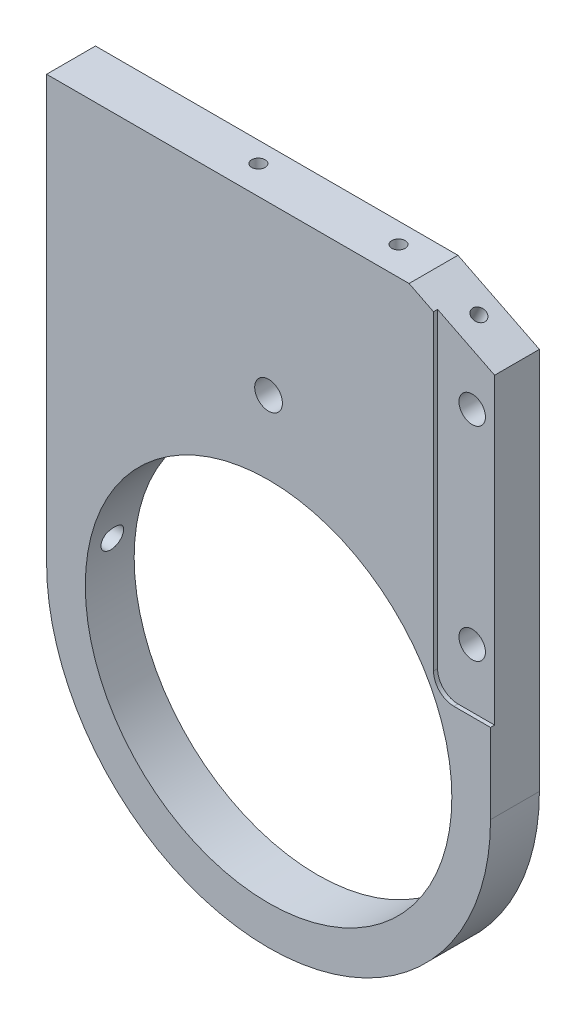
ISO-10303-21;
HEADER;
FILE_DESCRIPTION(('STEP AP214'),'2;1');
FILE_NAME('part.step','',(''),(''),'','','');
FILE_SCHEMA(('AUTOMOTIVE_DESIGN { 1 0 10303 214 1 1 1 1 }'));
ENDSEC;
DATA;
#1=APPLICATION_CONTEXT('core data for automotive mechanical design processes');
#2=APPLICATION_PROTOCOL_DEFINITION('international standard','automotive_design',2000,#1);
#3=PRODUCT_CONTEXT('',#1,'mechanical');
#4=PRODUCT('Part','Part','',(#3));
#5=PRODUCT_RELATED_PRODUCT_CATEGORY('part','',(#4));
#6=PRODUCT_DEFINITION_FORMATION('','',#4);
#7=PRODUCT_DEFINITION_CONTEXT('part definition',#1,'design');
#8=PRODUCT_DEFINITION('design','',#6,#7);
#9=PRODUCT_DEFINITION_SHAPE('','',#8);
#10=(LENGTH_UNIT() NAMED_UNIT(*) SI_UNIT(.MILLI.,.METRE.));
#11=(NAMED_UNIT(*) PLANE_ANGLE_UNIT() SI_UNIT($,.RADIAN.));
#12=(NAMED_UNIT(*) SI_UNIT($,.STERADIAN.) SOLID_ANGLE_UNIT());
#13=UNCERTAINTY_MEASURE_WITH_UNIT(LENGTH_MEASURE(1.E-05),#10,'distance_accuracy_value','');
#14=(GEOMETRIC_REPRESENTATION_CONTEXT(3) GLOBAL_UNCERTAINTY_ASSIGNED_CONTEXT((#13)) GLOBAL_UNIT_ASSIGNED_CONTEXT((#10,
#11,#12)) REPRESENTATION_CONTEXT('',''));
#15=CARTESIAN_POINT('',(0.,0.,0.));
#16=DIRECTION('',(0.,0.,1.));
#17=DIRECTION('',(1.,0.,0.));
#18=AXIS2_PLACEMENT_3D('',#15,#16,#17);
#19=CARTESIAN_POINT('',(49.,34.,-32.7));
#20=DIRECTION('',(0.,0.,1.));
#21=DIRECTION('',(1.,0.,0.));
#22=AXIS2_PLACEMENT_3D('',#19,#20,#21);
#23=CYLINDRICAL_SURFACE('',#22,3.25);
#24=CARTESIAN_POINT('',(49.,34.,5.));
#25=DIRECTION('',(0.,0.,1.));
#26=DIRECTION('',(1.,0.,0.));
#27=AXIS2_PLACEMENT_3D('',#24,#25,#26);
#28=CIRCLE('',#27,3.25);
#29=CARTESIAN_POINT('',(52.25,34.,5.));
#30=VERTEX_POINT('',#29);
#31=EDGE_CURVE('E210',#30,#30,#28,.T.);
#32=ORIENTED_EDGE('',*,*,#31,.T.);
#33=EDGE_LOOP('',(#32));
#34=FACE_BOUND('',#33,.T.);
#35=CARTESIAN_POINT('',(49.,34.,0.));
#36=DIRECTION('',(0.,0.,-1.));
#37=DIRECTION('',(-1.,0.,0.));
#38=AXIS2_PLACEMENT_3D('',#35,#36,#37);
#39=CIRCLE('',#38,3.25);
#40=CARTESIAN_POINT('',(45.75,34.,0.));
#41=VERTEX_POINT('',#40);
#42=EDGE_CURVE('E212',#41,#41,#39,.F.);
#43=ORIENTED_EDGE('',*,*,#42,.F.);
#44=EDGE_LOOP('',(#43));
#45=FACE_BOUND('',#44,.T.);
#46=ADVANCED_FACE('F36',(#34,#45),#23,.F.);
#47=CARTESIAN_POINT('',(49.,84.,-32.7));
#48=DIRECTION('',(0.,0.,1.));
#49=DIRECTION('',(1.,0.,0.));
#50=AXIS2_PLACEMENT_3D('',#47,#48,#49);
#51=CYLINDRICAL_SURFACE('',#50,3.25);
#52=CARTESIAN_POINT('',(49.,84.,5.));
#53=DIRECTION('',(0.,0.,1.));
#54=DIRECTION('',(1.,0.,0.));
#55=AXIS2_PLACEMENT_3D('',#52,#53,#54);
#56=CIRCLE('',#55,3.25);
#57=CARTESIAN_POINT('',(52.25,84.,5.));
#58=VERTEX_POINT('',#57);
#59=EDGE_CURVE('E343',#58,#58,#56,.T.);
#60=ORIENTED_EDGE('',*,*,#59,.T.);
#61=EDGE_LOOP('',(#60));
#62=FACE_BOUND('',#61,.T.);
#63=CARTESIAN_POINT('',(49.,84.,0.));
#64=DIRECTION('',(0.,0.,-1.));
#65=DIRECTION('',(-1.,0.,0.));
#66=AXIS2_PLACEMENT_3D('',#63,#64,#65);
#67=CIRCLE('',#66,3.25);
#68=CARTESIAN_POINT('',(45.75,84.,0.));
#69=VERTEX_POINT('',#68);
#70=EDGE_CURVE('E207',#69,#69,#67,.F.);
#71=ORIENTED_EDGE('',*,*,#70,.F.);
#72=EDGE_LOOP('',(#71));
#73=FACE_BOUND('',#72,.T.);
#74=ADVANCED_FACE('F264',(#62,#73),#51,.F.);
#75=CARTESIAN_POINT('',(0.,0.,6.));
#76=DIRECTION('',(0.,0.,1.));
#77=DIRECTION('',(1.,0.,0.));
#78=AXIS2_PLACEMENT_3D('',#75,#76,#77);
#79=PLANE('',#78);
#80=CARTESIAN_POINT('',(0.,63.,6.));
#81=DIRECTION('',(0.,0.,1.));
#82=DIRECTION('',(1.,0.,0.));
#83=AXIS2_PLACEMENT_3D('',#80,#81,#82);
#84=CIRCLE('',#83,3.39999999999999);
#85=CARTESIAN_POINT('',(3.39999999999999,63.,6.));
#86=VERTEX_POINT('',#85);
#87=EDGE_CURVE('E378',#86,#86,#84,.T.);
#88=ORIENTED_EDGE('',*,*,#87,.F.);
#89=EDGE_LOOP('',(#88));
#90=FACE_BOUND('',#89,.T.);
#91=DIRECTION('',(0.,-1.,0.));
#92=VECTOR('',#91,1.);
#93=CARTESIAN_POINT('',(40.5,104.,6.));
#94=LINE('',#93,#92);
#95=CARTESIAN_POINT('',(40.5,101.,6.));
#96=VERTEX_POINT('',#95);
#97=CARTESIAN_POINT('',(40.5,24.6,6.));
#98=VERTEX_POINT('',#97);
#99=EDGE_CURVE('E341',#96,#98,#94,.T.);
#100=ORIENTED_EDGE('',*,*,#99,.F.);
#101=DIRECTION('',(-0.894427190999916,0.447213595499958,0.));
#102=VECTOR('',#101,1.);
#103=CARTESIAN_POINT('',(34.5,104.,6.));
#104=LINE('',#103,#102);
#105=CARTESIAN_POINT('',(34.5,104.,6.));
#106=VERTEX_POINT('',#105);
#107=EDGE_CURVE('E170',#96,#106,#104,.T.);
#108=ORIENTED_EDGE('',*,*,#107,.T.);
#109=DIRECTION('',(-1.,0.,0.));
#110=VECTOR('',#109,1.);
#111=CARTESIAN_POINT('',(-54.5,104.,6.));
#112=LINE('',#111,#110);
#113=CARTESIAN_POINT('',(-54.5,104.,6.));
#114=VERTEX_POINT('',#113);
#115=EDGE_CURVE('E172',#106,#114,#112,.T.);
#116=ORIENTED_EDGE('',*,*,#115,.T.);
#117=DIRECTION('',(0.,-1.,0.));
#118=VECTOR('',#117,1.);
#119=CARTESIAN_POINT('',(-54.5,0.,6.));
#120=LINE('',#119,#118);
#121=CARTESIAN_POINT('',(-54.5,0.,6.));
#122=VERTEX_POINT('',#121);
#123=EDGE_CURVE('E174',#114,#122,#120,.T.);
#124=ORIENTED_EDGE('',*,*,#123,.T.);
#125=CARTESIAN_POINT('',(0.,0.,6.));
#126=DIRECTION('',(0.,0.,1.));
#127=DIRECTION('',(1.,0.,0.));
#128=AXIS2_PLACEMENT_3D('',#125,#126,#127);
#129=CIRCLE('',#128,54.5);
#130=CARTESIAN_POINT('',(54.5,0.,6.));
#131=VERTEX_POINT('',#130);
#132=EDGE_CURVE('E163',#122,#131,#129,.T.);
#133=ORIENTED_EDGE('',*,*,#132,.T.);
#134=DIRECTION('',(0.,1.,0.));
#135=VECTOR('',#134,1.);
#136=CARTESIAN_POINT('',(54.5,94.,6.));
#137=LINE('',#136,#135);
#138=CARTESIAN_POINT('',(54.5,19.6,6.));
#139=VERTEX_POINT('',#138);
#140=EDGE_CURVE('E166',#131,#139,#137,.T.);
#141=ORIENTED_EDGE('',*,*,#140,.T.);
#142=DIRECTION('',(1.,0.,0.));
#143=VECTOR('',#142,1.);
#144=CARTESIAN_POINT('',(45.5,19.6,6.));
#145=LINE('',#144,#143);
#146=CARTESIAN_POINT('',(45.5,19.6,6.));
#147=VERTEX_POINT('',#146);
#148=EDGE_CURVE('E335',#147,#139,#145,.T.);
#149=ORIENTED_EDGE('',*,*,#148,.F.);
#150=CARTESIAN_POINT('',(45.5,24.6,6.));
#151=DIRECTION('',(0.,0.,1.));
#152=DIRECTION('',(1.,0.,0.));
#153=AXIS2_PLACEMENT_3D('',#150,#151,#152);
#154=CIRCLE('',#153,5.);
#155=EDGE_CURVE('E338',#98,#147,#154,.T.);
#156=ORIENTED_EDGE('',*,*,#155,.F.);
#157=EDGE_LOOP('',(#100,#108,#116,#124,#133,#141,#149,#156));
#158=FACE_BOUND('',#157,.T.);
#159=CARTESIAN_POINT('',(0.,0.,6.));
#160=DIRECTION('',(0.,0.,1.));
#161=DIRECTION('',(1.,0.,0.));
#162=AXIS2_PLACEMENT_3D('',#159,#160,#161);
#163=CIRCLE('',#162,45.);
#164=CARTESIAN_POINT('',(45.,0.,6.));
#165=VERTEX_POINT('',#164);
#166=EDGE_CURVE('E150',#165,#165,#163,.T.);
#167=ORIENTED_EDGE('',*,*,#166,.F.);
#168=EDGE_LOOP('',(#167));
#169=FACE_BOUND('',#168,.T.);
#170=ADVANCED_FACE('F268',(#90,#158,#169),#79,.T.);
#171=CARTESIAN_POINT('',(0.,0.,-6.));
#172=DIRECTION('',(0.,0.,1.));
#173=DIRECTION('',(1.,0.,0.));
#174=AXIS2_PLACEMENT_3D('',#171,#172,#173);
#175=PLANE('',#174);
#176=CARTESIAN_POINT('',(0.,63.,-6.));
#177=DIRECTION('',(0.,0.,1.));
#178=DIRECTION('',(1.,0.,0.));
#179=AXIS2_PLACEMENT_3D('',#176,#177,#178);
#180=CIRCLE('',#179,3.4);
#181=CARTESIAN_POINT('',(3.4,63.,-6.));
#182=VERTEX_POINT('',#181);
#183=EDGE_CURVE('E375',#182,#182,#180,.T.);
#184=ORIENTED_EDGE('',*,*,#183,.T.);
#185=EDGE_LOOP('',(#184));
#186=FACE_BOUND('',#185,.T.);
#187=CARTESIAN_POINT('',(49.,34.,-6.));
#188=DIRECTION('',(0.,0.,-1.));
#189=DIRECTION('',(-1.,0.,0.));
#190=AXIS2_PLACEMENT_3D('',#187,#188,#189);
#191=CIRCLE('',#190,5.);
#192=CARTESIAN_POINT('',(44.,34.,-6.));
#193=VERTEX_POINT('',#192);
#194=EDGE_CURVE('E357',#193,#193,#191,.T.);
#195=ORIENTED_EDGE('',*,*,#194,.F.);
#196=EDGE_LOOP('',(#195));
#197=FACE_BOUND('',#196,.T.);
#198=CARTESIAN_POINT('',(49.,84.,-6.));
#199=DIRECTION('',(0.,0.,-1.));
#200=DIRECTION('',(-1.,0.,0.));
#201=AXIS2_PLACEMENT_3D('',#198,#199,#200);
#202=CIRCLE('',#201,5.);
#203=CARTESIAN_POINT('',(44.,84.,-6.));
#204=VERTEX_POINT('',#203);
#205=EDGE_CURVE('E214',#204,#204,#202,.T.);
#206=ORIENTED_EDGE('',*,*,#205,.F.);
#207=EDGE_LOOP('',(#206));
#208=FACE_BOUND('',#207,.T.);
#209=CARTESIAN_POINT('',(0.,0.,-6.));
#210=DIRECTION('',(0.,0.,1.));
#211=DIRECTION('',(1.,0.,0.));
#212=AXIS2_PLACEMENT_3D('',#209,#210,#211);
#213=CIRCLE('',#212,54.5);
#214=CARTESIAN_POINT('',(-54.5,0.,-6.));
#215=VERTEX_POINT('',#214);
#216=CARTESIAN_POINT('',(54.5,0.,-6.));
#217=VERTEX_POINT('',#216);
#218=EDGE_CURVE('E157',#215,#217,#213,.T.);
#219=ORIENTED_EDGE('',*,*,#218,.F.);
#220=DIRECTION('',(0.,-1.,0.));
#221=VECTOR('',#220,1.);
#222=CARTESIAN_POINT('',(-54.5,0.,-6.));
#223=LINE('',#222,#221);
#224=CARTESIAN_POINT('',(-54.5,104.,-6.));
#225=VERTEX_POINT('',#224);
#226=EDGE_CURVE('E167',#225,#215,#223,.T.);
#227=ORIENTED_EDGE('',*,*,#226,.F.);
#228=DIRECTION('',(-1.,0.,0.));
#229=VECTOR('',#228,1.);
#230=CARTESIAN_POINT('',(-54.5,104.,-6.));
#231=LINE('',#230,#229);
#232=CARTESIAN_POINT('',(34.5,104.,-6.));
#233=VERTEX_POINT('',#232);
#234=EDGE_CURVE('E184',#233,#225,#231,.T.);
#235=ORIENTED_EDGE('',*,*,#234,.F.);
#236=DIRECTION('',(-0.894427190999916,0.447213595499958,0.));
#237=VECTOR('',#236,1.);
#238=CARTESIAN_POINT('',(34.5,104.,-6.));
#239=LINE('',#238,#237);
#240=CARTESIAN_POINT('',(54.5,94.,-6.));
#241=VERTEX_POINT('',#240);
#242=EDGE_CURVE('E182',#241,#233,#239,.T.);
#243=ORIENTED_EDGE('',*,*,#242,.F.);
#244=DIRECTION('',(0.,1.,0.));
#245=VECTOR('',#244,1.);
#246=CARTESIAN_POINT('',(54.5,94.,-6.));
#247=LINE('',#246,#245);
#248=EDGE_CURVE('E179',#217,#241,#247,.T.);
#249=ORIENTED_EDGE('',*,*,#248,.F.);
#250=EDGE_LOOP('',(#219,#227,#235,#243,#249));
#251=FACE_BOUND('',#250,.T.);
#252=CARTESIAN_POINT('',(0.,0.,-6.));
#253=DIRECTION('',(0.,0.,1.));
#254=DIRECTION('',(1.,0.,0.));
#255=AXIS2_PLACEMENT_3D('',#252,#253,#254);
#256=CIRCLE('',#255,45.);
#257=CARTESIAN_POINT('',(45.,0.,-6.));
#258=VERTEX_POINT('',#257);
#259=EDGE_CURVE('E153',#258,#258,#256,.T.);
#260=ORIENTED_EDGE('',*,*,#259,.T.);
#261=EDGE_LOOP('',(#260));
#262=FACE_BOUND('',#261,.T.);
#263=ADVANCED_FACE('F386',(#186,#197,#208,#251,#262),#175,.F.);
#264=CARTESIAN_POINT('',(0.,0.,6.));
#265=DIRECTION('',(0.,0.,-1.));
#266=DIRECTION('',(-1.,0.,0.));
#267=AXIS2_PLACEMENT_3D('',#264,#265,#266);
#268=CYLINDRICAL_SURFACE('',#267,54.5);
#269=ORIENTED_EDGE('',*,*,#218,.T.);
#270=DIRECTION('',(0.,0.,-1.));
#271=VECTOR('',#270,1.);
#272=CARTESIAN_POINT('',(54.5,0.,6.));
#273=LINE('',#272,#271);
#274=EDGE_CURVE('E197',#131,#217,#273,.T.);
#275=ORIENTED_EDGE('',*,*,#274,.F.);
#276=ORIENTED_EDGE('',*,*,#132,.F.);
#277=DIRECTION('',(0.,0.,-1.));
#278=VECTOR('',#277,1.);
#279=CARTESIAN_POINT('',(-54.5,0.,6.));
#280=LINE('',#279,#278);
#281=EDGE_CURVE('E176',#122,#215,#280,.T.);
#282=ORIENTED_EDGE('',*,*,#281,.T.);
#283=EDGE_LOOP('',(#269,#275,#276,#282));
#284=FACE_BOUND('',#283,.T.);
#285=ADVANCED_FACE('F38',(#284),#268,.T.);
#286=CARTESIAN_POINT('',(54.5,94.,6.));
#287=DIRECTION('',(-1.,0.,0.));
#288=DIRECTION('',(0.,-1.,0.));
#289=AXIS2_PLACEMENT_3D('',#286,#287,#288);
#290=PLANE('',#289);
#291=DIRECTION('',(0.,1.,0.));
#292=VECTOR('',#291,1.);
#293=CARTESIAN_POINT('',(54.5,94.,5.));
#294=LINE('',#293,#292);
#295=CARTESIAN_POINT('',(54.5,19.6,5.));
#296=VERTEX_POINT('',#295);
#297=CARTESIAN_POINT('',(54.5,94.,5.));
#298=VERTEX_POINT('',#297);
#299=EDGE_CURVE('E63',#296,#298,#294,.T.);
#300=ORIENTED_EDGE('',*,*,#299,.F.);
#301=DIRECTION('',(0.,0.,1.));
#302=VECTOR('',#301,1.);
#303=CARTESIAN_POINT('',(54.5,19.6,6.));
#304=LINE('',#303,#302);
#305=EDGE_CURVE('E135',#296,#139,#304,.T.);
#306=ORIENTED_EDGE('',*,*,#305,.T.);
#307=ORIENTED_EDGE('',*,*,#140,.F.);
#308=ORIENTED_EDGE('',*,*,#274,.T.);
#309=ORIENTED_EDGE('',*,*,#248,.T.);
#310=DIRECTION('',(0.,0.,-1.));
#311=VECTOR('',#310,1.);
#312=CARTESIAN_POINT('',(54.5,94.,6.));
#313=LINE('',#312,#311);
#314=EDGE_CURVE('E195',#298,#241,#313,.T.);
#315=ORIENTED_EDGE('',*,*,#314,.F.);
#316=EDGE_LOOP('',(#300,#306,#307,#308,#309,#315));
#317=FACE_BOUND('',#316,.T.);
#318=ADVANCED_FACE('F411',(#317),#290,.F.);
#319=CARTESIAN_POINT('',(34.5,104.,6.));
#320=DIRECTION('',(-0.447213595499958,-0.894427190999916,0.));
#321=DIRECTION('',(0.894427190999916,-0.447213595499958,0.));
#322=AXIS2_PLACEMENT_3D('',#319,#320,#321);
#323=PLANE('',#322);
#324=CARTESIAN_POINT('',(44.6613008990009,98.9193495504995,-1.));
#325=DIRECTION('',(0.447213595499958,0.894427190999916,0.));
#326=DIRECTION('',(-0.894427190999916,0.447213595499958,0.));
#327=AXIS2_PLACEMENT_3D('',#324,#325,#326);
#328=CIRCLE('',#327,1.64999999999999);
#329=CARTESIAN_POINT('',(43.1854960338511,99.6572519830745,-1.));
#330=VERTEX_POINT('',#329);
#331=EDGE_CURVE('E160',#330,#330,#328,.T.);
#332=ORIENTED_EDGE('',*,*,#331,.F.);
#333=EDGE_LOOP('',(#332));
#334=FACE_BOUND('',#333,.T.);
#335=ORIENTED_EDGE('',*,*,#107,.F.);
#336=DIRECTION('',(0.,0.,-1.));
#337=VECTOR('',#336,1.);
#338=CARTESIAN_POINT('',(40.5,101.,6.));
#339=LINE('',#338,#337);
#340=CARTESIAN_POINT('',(40.5,101.,5.));
#341=VERTEX_POINT('',#340);
#342=EDGE_CURVE('E202',#96,#341,#339,.T.);
#343=ORIENTED_EDGE('',*,*,#342,.T.);
#344=DIRECTION('',(-0.894427190999916,0.447213595499958,0.));
#345=VECTOR('',#344,1.);
#346=CARTESIAN_POINT('',(34.5,104.,5.));
#347=LINE('',#346,#345);
#348=EDGE_CURVE('E200',#298,#341,#347,.T.);
#349=ORIENTED_EDGE('',*,*,#348,.F.);
#350=ORIENTED_EDGE('',*,*,#314,.T.);
#351=ORIENTED_EDGE('',*,*,#242,.T.);
#352=DIRECTION('',(0.,0.,-1.));
#353=VECTOR('',#352,1.);
#354=CARTESIAN_POINT('',(34.5,104.,6.));
#355=LINE('',#354,#353);
#356=EDGE_CURVE('E192',#106,#233,#355,.T.);
#357=ORIENTED_EDGE('',*,*,#356,.F.);
#358=EDGE_LOOP('',(#335,#343,#349,#350,#351,#357));
#359=FACE_BOUND('',#358,.T.);
#360=ADVANCED_FACE('F395',(#334,#359),#323,.F.);
#361=CARTESIAN_POINT('',(-54.5,104.,6.));
#362=DIRECTION('',(0.,-1.,0.));
#363=DIRECTION('',(0.,0.,-1.));
#364=AXIS2_PLACEMENT_3D('',#361,#362,#363);
#365=PLANE('',#364);
#366=CARTESIAN_POINT('',(-9.5,104.,-1.));
#367=DIRECTION('',(0.,1.,0.));
#368=DIRECTION('',(0.,0.,1.));
#369=AXIS2_PLACEMENT_3D('',#366,#367,#368);
#370=CIRCLE('',#369,1.64999999999999);
#371=CARTESIAN_POINT('',(-9.5,104.,0.64999999999999));
#372=VERTEX_POINT('',#371);
#373=EDGE_CURVE('E325',#372,#372,#370,.T.);
#374=ORIENTED_EDGE('',*,*,#373,.F.);
#375=EDGE_LOOP('',(#374));
#376=FACE_BOUND('',#375,.T.);
#377=CARTESIAN_POINT('',(24.9,104.,-1.));
#378=DIRECTION('',(0.,1.,0.));
#379=DIRECTION('',(0.,0.,1.));
#380=AXIS2_PLACEMENT_3D('',#377,#378,#379);
#381=CIRCLE('',#380,1.64999999999999);
#382=CARTESIAN_POINT('',(24.9,104.,0.649999999999992));
#383=VERTEX_POINT('',#382);
#384=EDGE_CURVE('E317',#383,#383,#381,.T.);
#385=ORIENTED_EDGE('',*,*,#384,.F.);
#386=EDGE_LOOP('',(#385));
#387=FACE_BOUND('',#386,.T.);
#388=ORIENTED_EDGE('',*,*,#234,.T.);
#389=DIRECTION('',(0.,0.,-1.));
#390=VECTOR('',#389,1.);
#391=CARTESIAN_POINT('',(-54.5,104.,6.));
#392=LINE('',#391,#390);
#393=EDGE_CURVE('E189',#114,#225,#392,.T.);
#394=ORIENTED_EDGE('',*,*,#393,.F.);
#395=ORIENTED_EDGE('',*,*,#115,.F.);
#396=ORIENTED_EDGE('',*,*,#356,.T.);
#397=EDGE_LOOP('',(#388,#394,#395,#396));
#398=FACE_BOUND('',#397,.T.);
#399=ADVANCED_FACE('F401',(#376,#387,#398),#365,.F.);
#400=CARTESIAN_POINT('',(-54.5,0.,6.));
#401=DIRECTION('',(1.,0.,0.));
#402=DIRECTION('',(0.,0.,-1.));
#403=AXIS2_PLACEMENT_3D('',#400,#401,#402);
#404=PLANE('',#403);
#405=CARTESIAN_POINT('',(-54.5,7.49999999999999,0.));
#406=DIRECTION('',(-1.,0.,0.));
#407=DIRECTION('',(0.,0.,1.));
#408=AXIS2_PLACEMENT_3D('',#405,#406,#407);
#409=CIRCLE('',#408,2.74999999999999);
#410=CARTESIAN_POINT('',(-54.5,7.49999999999999,2.74999999999999));
#411=VERTEX_POINT('',#410);
#412=EDGE_CURVE('E140',#411,#411,#409,.T.);
#413=ORIENTED_EDGE('',*,*,#412,.F.);
#414=EDGE_LOOP('',(#413));
#415=FACE_BOUND('',#414,.T.);
#416=CARTESIAN_POINT('',(-54.5,96.5,0.));
#417=DIRECTION('',(-1.,0.,0.));
#418=DIRECTION('',(0.,0.,1.));
#419=AXIS2_PLACEMENT_3D('',#416,#417,#418);
#420=CIRCLE('',#419,2.75);
#421=CARTESIAN_POINT('',(-54.5,96.5,2.75));
#422=VERTEX_POINT('',#421);
#423=EDGE_CURVE('E139',#422,#422,#420,.T.);
#424=ORIENTED_EDGE('',*,*,#423,.F.);
#425=EDGE_LOOP('',(#424));
#426=FACE_BOUND('',#425,.T.);
#427=CARTESIAN_POINT('',(-54.5,51.7,0.));
#428=DIRECTION('',(-1.,0.,0.));
#429=DIRECTION('',(0.,0.,1.));
#430=AXIS2_PLACEMENT_3D('',#427,#428,#429);
#431=CIRCLE('',#430,2.75);
#432=CARTESIAN_POINT('',(-54.5,51.7,2.75));
#433=VERTEX_POINT('',#432);
#434=EDGE_CURVE('E365',#433,#433,#431,.T.);
#435=ORIENTED_EDGE('',*,*,#434,.F.);
#436=EDGE_LOOP('',(#435));
#437=FACE_BOUND('',#436,.T.);
#438=ORIENTED_EDGE('',*,*,#226,.T.);
#439=ORIENTED_EDGE('',*,*,#281,.F.);
#440=ORIENTED_EDGE('',*,*,#123,.F.);
#441=ORIENTED_EDGE('',*,*,#393,.T.);
#442=EDGE_LOOP('',(#438,#439,#440,#441));
#443=FACE_BOUND('',#442,.T.);
#444=ADVANCED_FACE('F146',(#415,#426,#437,#443),#404,.F.);
#445=CARTESIAN_POINT('',(0.,0.,6.));
#446=DIRECTION('',(0.,0.,-1.));
#447=DIRECTION('',(-1.,0.,0.));
#448=AXIS2_PLACEMENT_3D('',#445,#446,#447);
#449=CYLINDRICAL_SURFACE('',#448,45.);
#450=CARTESIAN_POINT('',(-44.,9.43398113205663,1.95504909934479));
#451=CARTESIAN_POINT('',(-44.011976021534,9.37812817582706,2.01030953073757));
#452=CARTESIAN_POINT('',(-44.0243392489959,9.31994446006084,2.06312057347542));
#453=CARTESIAN_POINT('',(-44.0496926743651,9.19936710301397,2.16351474603789));
#454=CARTESIAN_POINT('',(-44.0626828013166,9.13697393786539,2.21109846553168));
#455=CARTESIAN_POINT('',(-44.0891346342798,9.00846854245604,2.30068517372426));
#456=CARTESIAN_POINT('',(-44.1025959496674,8.9423593665238,2.34269265296342));
#457=CARTESIAN_POINT('',(-44.1298510423062,8.80687435804059,2.42088939501922));
#458=CARTESIAN_POINT('',(-44.1436448224585,8.73749849698125,2.45707860704766));
#459=CARTESIAN_POINT('',(-44.1853182362214,8.52515995560349,2.55654566055899));
#460=CARTESIAN_POINT('',(-44.2135096202768,8.37789135292483,2.61078894545374));
#461=CARTESIAN_POINT('',(-44.2695883751528,8.0763290525313,2.6934775454239));
#462=CARTESIAN_POINT('',(-44.2974757752716,7.92203603938962,2.72192536880188));
#463=CARTESIAN_POINT('',(-44.3521627701137,7.60991767058596,2.75228924053482));
#464=CARTESIAN_POINT('',(-44.3789569013564,7.45207953799485,2.75408524707613));
#465=CARTESIAN_POINT('',(-44.4305432707907,7.13807738970346,2.7306233738791));
#466=CARTESIAN_POINT('',(-44.4553353411416,6.98191351531269,2.70536322844259));
#467=CARTESIAN_POINT('',(-44.5021565750129,6.67695294676972,2.62861860087987));
#468=CARTESIAN_POINT('',(-44.5242043603484,6.52811127444672,2.57732439937338));
#469=CARTESIAN_POINT('',(-44.565353005728,6.24102214648032,2.44992477960135));
#470=CARTESIAN_POINT('',(-44.5844542048507,6.10277347276964,2.37382221930208));
#471=CARTESIAN_POINT('',(-44.6192839779886,5.84264807884854,2.19996769585594));
#472=CARTESIAN_POINT('',(-44.6350510719407,5.72059122786549,2.10249293822605));
#473=CARTESIAN_POINT('',(-44.663442683045,5.49453307413643,1.88808545982193));
#474=CARTESIAN_POINT('',(-44.6760673172066,5.39053109916194,1.77115346380728));
#475=CARTESIAN_POINT('',(-44.6981031355216,5.20464026067518,1.52239886332193));
#476=CARTESIAN_POINT('',(-44.7075445381488,5.12254508898798,1.39073306443497));
#477=CARTESIAN_POINT('',(-44.7234715794312,4.98158061329772,1.11534252523343));
#478=CARTESIAN_POINT('',(-44.7299573216891,4.92271049521346,0.971618207806483));
#479=CARTESIAN_POINT('',(-44.740043135687,4.83018743556319,0.676993480399499));
#480=CARTESIAN_POINT('',(-44.7436579406977,4.79640580202051,0.526133974646954));
#481=CARTESIAN_POINT('',(-44.7481245057342,4.75455617031421,0.220849675160403));
#482=CARTESIAN_POINT('',(-44.7489762980504,4.74648787164722,0.0664249231135126));
#483=CARTESIAN_POINT('',(-44.7479351438064,4.75629289915102,-0.241298669144267));
#484=CARTESIAN_POINT('',(-44.7460473310182,4.77411770405075,-0.394599075619909));
#485=CARTESIAN_POINT('',(-44.7394989263067,4.83509719956772,-0.69601361669375));
#486=CARTESIAN_POINT('',(-44.7348383537977,4.87825171282987,-0.844127787597554));
#487=CARTESIAN_POINT('',(-44.722663687512,4.9886286718399,-1.13098816214159));
#488=CARTESIAN_POINT('',(-44.7151493262502,5.05585337364805,-1.26973348620542));
#489=CARTESIAN_POINT('',(-44.6971712095349,5.21239557321871,-1.53393053988222));
#490=CARTESIAN_POINT('',(-44.6867074366263,5.30171320173026,-1.6593821908151));
#491=CARTESIAN_POINT('',(-44.6627312890588,5.5000366253367,-1.89374257370767));
#492=CARTESIAN_POINT('',(-44.6492124305316,5.60908419407499,-2.00261528506094));
#493=CARTESIAN_POINT('',(-44.6191318594803,5.84354466289036,-2.20049760583164));
#494=CARTESIAN_POINT('',(-44.6025701338542,5.96895763343341,-2.28950712971789));
#495=CARTESIAN_POINT('',(-44.5664045625187,6.2332533077424,-2.44572011953484));
#496=CARTESIAN_POINT('',(-44.5467843255625,6.37220697995784,-2.51279967958187));
#497=CARTESIAN_POINT('',(-44.5048168983019,6.65899862311615,-2.62274786896567));
#498=CARTESIAN_POINT('',(-44.4824694803054,6.80683733534615,-2.66561447508216));
#499=CARTESIAN_POINT('',(-44.4352255721939,7.10874776278966,-2.72642101235874));
#500=CARTESIAN_POINT('',(-44.4103056381772,7.26286731613983,-2.74410508257451));
#501=CARTESIAN_POINT('',(-44.3587140064557,7.57159092577081,-2.75340307354191));
#502=CARTESIAN_POINT('',(-44.3320422647357,7.72619499413229,-2.74501633900618));
#503=CARTESIAN_POINT('',(-44.2773879949955,8.03352812387547,-2.70226044273402));
#504=CARTESIAN_POINT('',(-44.2493933951712,8.18621086857198,-2.66757358351646));
#505=CARTESIAN_POINT('',(-44.1933639970025,8.48348213699479,-2.57285819899017));
#506=CARTESIAN_POINT('',(-44.1653292017919,8.62807125990156,-2.51283155243373));
#507=CARTESIAN_POINT('',(-44.1134985751028,8.88902977718555,-2.37741727319364));
#508=CARTESIAN_POINT('',(-44.0895889682021,9.00672539640449,-2.30462836049459));
#509=CARTESIAN_POINT('',(-44.0549439066811,9.1741584471633,-2.18276694276359));
#510=CARTESIAN_POINT('',(-44.0435962374711,9.22846283599596,-2.14002184871292));
#511=CARTESIAN_POINT('',(-44.0214000625597,9.33376835199734,-2.05050424744928));
#512=CARTESIAN_POINT('',(-44.010551640033,9.38476892932272,-2.00373107285697));
#513=CARTESIAN_POINT('',(-44.,9.43398113205663,-1.95504909934479));
#514=B_SPLINE_CURVE_WITH_KNOTS('',3,(#450,#451,#452,#453,#454,#455,#456,#457,#458,#459,#460,
#461,#462,#463,#464,#465,#466,#467,#468,#469,#470,#471,#472,#473,#474,#475,#476,#477,#478,#479,
#480,#481,#482,#483,#484,#485,#486,#487,#488,#489,#490,#491,#492,#493,#494,#495,#496,#497,#498,
#499,#500,#501,#502,#503,#504,#505,#506,#507,#508,#509,#510,#511,#512,#513),.UNSPECIFIED.,.F.,
.F.,(4,2,2,2,2,2,2,2,2,2,2,2,2,2,2,2,2,2,2,2,2,2,2,2,2,2,2,2,2,2,2,4),(0.,0.238349708406422,
0.476672502060291,0.71480219500816,0.952933966499026,1.42884994235872,1.90471963607224,
2.38273203590036,2.86078446789944,3.33539211915668,3.80994511409395,4.27867312646997,
4.74738368317759,5.21151049417553,5.67562103522228,6.1373341482643,6.59904186539582,
7.05988550046381,7.52072590880736,7.98160952229683,8.44249586342537,8.90436969512156,
9.36624551561461,9.83068759472788,10.2951684766112,10.7643357297467,11.233514775455,
11.7084534829172,12.183356983473,12.6030237736965,12.8129565208491,13.0229241171853),.UNSPECIFIED.);
#515=CARTESIAN_POINT('',(-44.,9.43398113205663,1.95504909934479));
#516=VERTEX_POINT('',#515);
#517=CARTESIAN_POINT('',(-44.,9.43398113205663,-1.95504909934479));
#518=VERTEX_POINT('',#517);
#519=EDGE_CURVE('E11',#516,#518,#514,.T.);
#520=ORIENTED_EDGE('',*,*,#519,.F.);
#521=CARTESIAN_POINT('',(-44.1654366702326,8.62636677446982,-2.80783489157341));
#522=CARTESIAN_POINT('',(-44.1499597186301,8.70560844909689,-2.74828782425058));
#523=CARTESIAN_POINT('',(-44.1347571349064,8.7823064937893,-2.68536801510383));
#524=CARTESIAN_POINT('',(-44.1050752535846,8.93017441812751,-2.5531810096446));
#525=CARTESIAN_POINT('',(-44.0905959612993,9.00134425716954,-2.48391376671939));
#526=CARTESIAN_POINT('',(-44.0485179548386,9.2058363583088,-2.2672551682179));
#527=CARTESIAN_POINT('',(-44.0222647100553,9.33021411262185,-2.11095202929394));
#528=CARTESIAN_POINT('',(-43.9748864370287,9.55103028245376,-1.77926778880156));
#529=CARTESIAN_POINT('',(-43.9537580829596,9.64748682549906,-1.60389916748655));
#530=CARTESIAN_POINT('',(-43.9178904784435,9.80947540043491,-1.23887743859695));
#531=CARTESIAN_POINT('',(-43.9031472776892,9.87502655481516,-1.04923324839936));
#532=CARTESIAN_POINT('',(-43.8812432614702,9.97190715337074,-0.665069350116511));
#533=CARTESIAN_POINT('',(-43.8739350940435,10.0039020486525,-0.470725875424719));
#534=CARTESIAN_POINT('',(-43.8668767998707,10.0348086964237,-0.0792657676428278));
#535=CARTESIAN_POINT('',(-43.8671268606289,10.0337196281666,0.117850934124201));
#536=CARTESIAN_POINT('',(-43.8750756839739,9.99890111406923,0.504492670326159));
#537=CARTESIAN_POINT('',(-43.8826055752698,9.9659116625527,0.694088525356863));
#538=CARTESIAN_POINT('',(-43.9043797004795,9.8695418542053,1.06500059186718));
#539=CARTESIAN_POINT('',(-43.9186247915346,9.80615761770638,1.24631574313984));
#540=CARTESIAN_POINT('',(-43.9530942774833,9.65048617929729,1.5971786834387));
#541=CARTESIAN_POINT('',(-43.9733657165264,9.55797122155393,1.76662041966836));
#542=CARTESIAN_POINT('',(-44.0186904156076,9.34700320053431,2.08771747734018));
#543=CARTESIAN_POINT('',(-44.0437408089291,9.22856568099584,2.23938337424055));
#544=CARTESIAN_POINT('',(-44.0854263554831,9.02666186087815,2.45860838109798));
#545=CARTESIAN_POINT('',(-44.1008756083629,8.95093506491039,2.53367077091523));
#546=CARTESIAN_POINT('',(-44.1325919585728,8.793224570627,2.67638405555715));
#547=CARTESIAN_POINT('',(-44.1488574080042,8.71125331910819,2.74404907161071));
#548=CARTESIAN_POINT('',(-44.1654366702326,8.62636677446981,2.8078348915734));
#549=B_SPLINE_CURVE_WITH_KNOTS('',3,(#521,#522,#523,#524,#525,#526,#527,#528,#529,#530,#531,
#532,#533,#534,#535,#536,#537,#538,#539,#540,#541,#542,#543,#544,#545,#546,#547,#548),
.UNSPECIFIED.,.F.,.F.,(4,2,2,2,2,2,2,2,2,2,2,2,2,4),(0.,0.30078034921522,0.601562907404384,
1.20285432391675,1.80375447877213,2.40428234139359,2.99266204068942,3.58105633651336,
4.1561211426298,4.73125937103429,5.31101084635853,5.89041563771259,6.21323928782146,
6.53543550688594),.UNSPECIFIED.);
#550=EDGE_CURVE('E50',#518,#516,#549,.T.);
#551=ORIENTED_EDGE('',*,*,#550,.F.);
#552=EDGE_LOOP('',(#520,#551));
#553=FACE_BOUND('',#552,.T.);
#554=ORIENTED_EDGE('',*,*,#166,.T.);
#555=EDGE_LOOP('',(#554));
#556=FACE_BOUND('',#555,.T.);
#557=ORIENTED_EDGE('',*,*,#259,.F.);
#558=EDGE_LOOP('',(#557));
#559=FACE_BOUND('',#558,.T.);
#560=ADVANCED_FACE('F142',(#553,#556,#559),#449,.F.);
#561=CARTESIAN_POINT('',(35.7170289890018,81.0308057305012,-1.));
#562=DIRECTION('',(0.447213595499958,0.894427190999916,0.));
#563=DIRECTION('',(-0.894427190999916,0.447213595499958,0.));
#564=AXIS2_PLACEMENT_3D('',#561,#562,#563);
#565=CONICAL_SURFACE('',#564,1.65,1.02974425867665);
#566=CARTESIAN_POINT('',(35.2736524765828,80.1440527056634,-1.00000000000001));
#567=VERTEX_POINT('',#566);
#568=VERTEX_LOOP('',#567);
#569=FACE_BOUND('',#568,.T.);
#570=CARTESIAN_POINT('',(35.7170289890018,81.0308057305012,-1.));
#571=DIRECTION('',(0.447213595499958,0.894427190999916,0.));
#572=DIRECTION('',(-0.894427190999916,0.447213595499958,0.));
#573=AXIS2_PLACEMENT_3D('',#570,#571,#572);
#574=CIRCLE('',#573,1.65);
#575=CARTESIAN_POINT('',(34.2412241238519,81.7687081630762,-1.));
#576=VERTEX_POINT('',#575);
#577=EDGE_CURVE('E155',#576,#576,#574,.T.);
#578=ORIENTED_EDGE('',*,*,#577,.T.);
#579=EDGE_LOOP('',(#578));
#580=FACE_BOUND('',#579,.T.);
#581=ADVANCED_FACE('F145',(#569,#580),#565,.F.);
#582=CARTESIAN_POINT('',(44.6613008990009,98.9193495504995,-1.));
#583=DIRECTION('',(0.447213595499958,0.894427190999916,0.));
#584=DIRECTION('',(-0.894427190999916,0.447213595499958,0.));
#585=AXIS2_PLACEMENT_3D('',#582,#583,#584);
#586=CYLINDRICAL_SURFACE('',#585,1.64999999999999);
#587=ORIENTED_EDGE('',*,*,#577,.F.);
#588=EDGE_LOOP('',(#587));
#589=FACE_BOUND('',#588,.T.);
#590=ORIENTED_EDGE('',*,*,#331,.T.);
#591=EDGE_LOOP('',(#590));
#592=FACE_BOUND('',#591,.T.);
#593=ADVANCED_FACE('F300',(#589,#592),#586,.F.);
#594=CARTESIAN_POINT('',(24.9,84.,-1.));
#595=DIRECTION('',(0.,1.,0.));
#596=DIRECTION('',(0.,0.,1.));
#597=AXIS2_PLACEMENT_3D('',#594,#595,#596);
#598=CONICAL_SURFACE('',#597,1.64999999999998,1.02974425867665);
#599=CARTESIAN_POINT('',(24.9,83.0085799786045,-1.));
#600=VERTEX_POINT('',#599);
#601=VERTEX_LOOP('',#600);
#602=FACE_BOUND('',#601,.T.);
#603=CARTESIAN_POINT('',(24.9,84.,-1.));
#604=DIRECTION('',(0.,1.,0.));
#605=DIRECTION('',(0.,0.,1.));
#606=AXIS2_PLACEMENT_3D('',#603,#604,#605);
#607=CIRCLE('',#606,1.64999999999998);
#608=CARTESIAN_POINT('',(24.9,84.,0.649999999999985));
#609=VERTEX_POINT('',#608);
#610=EDGE_CURVE('E314',#609,#609,#607,.T.);
#611=ORIENTED_EDGE('',*,*,#610,.T.);
#612=EDGE_LOOP('',(#611));
#613=FACE_BOUND('',#612,.T.);
#614=ADVANCED_FACE('F296',(#602,#613),#598,.F.);
#615=CARTESIAN_POINT('',(24.9,104.,-1.));
#616=DIRECTION('',(0.,1.,0.));
#617=DIRECTION('',(0.,0.,1.));
#618=AXIS2_PLACEMENT_3D('',#615,#616,#617);
#619=CYLINDRICAL_SURFACE('',#618,1.64999999999999);
#620=ORIENTED_EDGE('',*,*,#610,.F.);
#621=EDGE_LOOP('',(#620));
#622=FACE_BOUND('',#621,.T.);
#623=ORIENTED_EDGE('',*,*,#384,.T.);
#624=EDGE_LOOP('',(#623));
#625=FACE_BOUND('',#624,.T.);
#626=ADVANCED_FACE('F292',(#622,#625),#619,.F.);
#627=CARTESIAN_POINT('',(-9.5,84.,-1.));
#628=DIRECTION('',(0.,1.,0.));
#629=DIRECTION('',(0.,0.,1.));
#630=AXIS2_PLACEMENT_3D('',#627,#628,#629);
#631=CONICAL_SURFACE('',#630,1.64999999999999,1.02974425867665);
#632=CARTESIAN_POINT('',(-9.50000000000001,83.0085799786045,-1.));
#633=VERTEX_POINT('',#632);
#634=VERTEX_LOOP('',#633);
#635=FACE_BOUND('',#634,.T.);
#636=CARTESIAN_POINT('',(-9.5,84.,-1.));
#637=DIRECTION('',(0.,1.,0.));
#638=DIRECTION('',(0.,0.,1.));
#639=AXIS2_PLACEMENT_3D('',#636,#637,#638);
#640=CIRCLE('',#639,1.64999999999999);
#641=CARTESIAN_POINT('',(-9.5,84.,0.649999999999986));
#642=VERTEX_POINT('',#641);
#643=EDGE_CURVE('E322',#642,#642,#640,.T.);
#644=ORIENTED_EDGE('',*,*,#643,.T.);
#645=EDGE_LOOP('',(#644));
#646=FACE_BOUND('',#645,.T.);
#647=ADVANCED_FACE('F288',(#635,#646),#631,.F.);
#648=CARTESIAN_POINT('',(-9.5,104.,-1.));
#649=DIRECTION('',(0.,1.,0.));
#650=DIRECTION('',(0.,0.,1.));
#651=AXIS2_PLACEMENT_3D('',#648,#649,#650);
#652=CYLINDRICAL_SURFACE('',#651,1.64999999999999);
#653=ORIENTED_EDGE('',*,*,#643,.F.);
#654=EDGE_LOOP('',(#653));
#655=FACE_BOUND('',#654,.T.);
#656=ORIENTED_EDGE('',*,*,#373,.T.);
#657=EDGE_LOOP('',(#656));
#658=FACE_BOUND('',#657,.T.);
#659=ADVANCED_FACE('F278',(#655,#658),#652,.F.);
#660=CARTESIAN_POINT('',(45.5,19.6,5.));
#661=DIRECTION('',(0.,-1.,0.));
#662=DIRECTION('',(0.,0.,-1.));
#663=AXIS2_PLACEMENT_3D('',#660,#661,#662);
#664=PLANE('',#663);
#665=DIRECTION('',(1.,0.,0.));
#666=VECTOR('',#665,1.);
#667=CARTESIAN_POINT('',(45.5,19.6,5.));
#668=LINE('',#667,#666);
#669=CARTESIAN_POINT('',(45.5,19.6,5.));
#670=VERTEX_POINT('',#669);
#671=EDGE_CURVE('E333',#670,#296,#668,.T.);
#672=ORIENTED_EDGE('',*,*,#671,.F.);
#673=DIRECTION('',(0.,0.,1.));
#674=VECTOR('',#673,1.);
#675=CARTESIAN_POINT('',(45.5,19.6,5.));
#676=LINE('',#675,#674);
#677=EDGE_CURVE('E329',#670,#147,#676,.T.);
#678=ORIENTED_EDGE('',*,*,#677,.T.);
#679=ORIENTED_EDGE('',*,*,#148,.T.);
#680=ORIENTED_EDGE('',*,*,#305,.F.);
#681=EDGE_LOOP('',(#672,#678,#679,#680));
#682=FACE_BOUND('',#681,.T.);
#683=ADVANCED_FACE('F275',(#682),#664,.F.);
#684=CARTESIAN_POINT('',(40.5,104.,5.));
#685=DIRECTION('',(-1.,0.,0.));
#686=DIRECTION('',(0.,-1.,0.));
#687=AXIS2_PLACEMENT_3D('',#684,#685,#686);
#688=PLANE('',#687);
#689=ORIENTED_EDGE('',*,*,#99,.T.);
#690=DIRECTION('',(0.,0.,1.));
#691=VECTOR('',#690,1.);
#692=CARTESIAN_POINT('',(40.5,24.6,5.));
#693=LINE('',#692,#691);
#694=CARTESIAN_POINT('',(40.5,24.6,5.));
#695=VERTEX_POINT('',#694);
#696=EDGE_CURVE('E330',#695,#98,#693,.T.);
#697=ORIENTED_EDGE('',*,*,#696,.F.);
#698=DIRECTION('',(0.,-1.,0.));
#699=VECTOR('',#698,1.);
#700=CARTESIAN_POINT('',(40.5,104.,5.));
#701=LINE('',#700,#699);
#702=EDGE_CURVE('E337',#341,#695,#701,.T.);
#703=ORIENTED_EDGE('',*,*,#702,.F.);
#704=ORIENTED_EDGE('',*,*,#342,.F.);
#705=EDGE_LOOP('',(#689,#697,#703,#704));
#706=FACE_BOUND('',#705,.T.);
#707=ADVANCED_FACE('F273',(#706),#688,.F.);
#708=CARTESIAN_POINT('',(45.5,24.6,5.));
#709=DIRECTION('',(0.,0.,1.));
#710=DIRECTION('',(1.,0.,0.));
#711=AXIS2_PLACEMENT_3D('',#708,#709,#710);
#712=PLANE('',#711);
#713=ORIENTED_EDGE('',*,*,#31,.F.);
#714=EDGE_LOOP('',(#713));
#715=FACE_BOUND('',#714,.T.);
#716=ORIENTED_EDGE('',*,*,#59,.F.);
#717=EDGE_LOOP('',(#716));
#718=FACE_BOUND('',#717,.T.);
#719=ORIENTED_EDGE('',*,*,#299,.T.);
#720=ORIENTED_EDGE('',*,*,#348,.T.);
#721=ORIENTED_EDGE('',*,*,#702,.T.);
#722=CARTESIAN_POINT('',(45.5,24.6,5.));
#723=DIRECTION('',(0.,0.,1.));
#724=DIRECTION('',(1.,0.,0.));
#725=AXIS2_PLACEMENT_3D('',#722,#723,#724);
#726=CIRCLE('',#725,5.);
#727=EDGE_CURVE('E345',#695,#670,#726,.T.);
#728=ORIENTED_EDGE('',*,*,#727,.T.);
#729=ORIENTED_EDGE('',*,*,#671,.T.);
#730=EDGE_LOOP('',(#719,#720,#721,#728,#729));
#731=FACE_BOUND('',#730,.T.);
#732=ADVANCED_FACE('F270',(#715,#718,#731),#712,.T.);
#733=CARTESIAN_POINT('',(45.5,24.6,5.));
#734=DIRECTION('',(0.,0.,1.));
#735=DIRECTION('',(1.,0.,0.));
#736=AXIS2_PLACEMENT_3D('',#733,#734,#735);
#737=CYLINDRICAL_SURFACE('',#736,5.);
#738=ORIENTED_EDGE('',*,*,#155,.T.);
#739=ORIENTED_EDGE('',*,*,#677,.F.);
#740=ORIENTED_EDGE('',*,*,#727,.F.);
#741=ORIENTED_EDGE('',*,*,#696,.T.);
#742=EDGE_LOOP('',(#738,#739,#740,#741));
#743=FACE_BOUND('',#742,.T.);
#744=ADVANCED_FACE('F257',(#743),#737,.F.);
#745=CARTESIAN_POINT('',(49.,84.,0.));
#746=DIRECTION('',(0.,0.,-1.));
#747=DIRECTION('',(-1.,0.,0.));
#748=AXIS2_PLACEMENT_3D('',#745,#746,#747);
#749=PLANE('',#748);
#750=CARTESIAN_POINT('',(49.,84.,0.));
#751=DIRECTION('',(0.,0.,-1.));
#752=DIRECTION('',(-1.,0.,0.));
#753=AXIS2_PLACEMENT_3D('',#750,#751,#752);
#754=CIRCLE('',#753,5.);
#755=CARTESIAN_POINT('',(44.,84.,0.));
#756=VERTEX_POINT('',#755);
#757=EDGE_CURVE('E211',#756,#756,#754,.T.);
#758=ORIENTED_EDGE('',*,*,#757,.T.);
#759=EDGE_LOOP('',(#758));
#760=FACE_BOUND('',#759,.T.);
#761=ORIENTED_EDGE('',*,*,#70,.T.);
#762=EDGE_LOOP('',(#761));
#763=FACE_BOUND('',#762,.T.);
#764=ADVANCED_FACE('F254',(#760,#763),#749,.T.);
#765=CARTESIAN_POINT('',(49.,84.,0.));
#766=DIRECTION('',(0.,0.,-1.));
#767=DIRECTION('',(-1.,0.,0.));
#768=AXIS2_PLACEMENT_3D('',#765,#766,#767);
#769=CYLINDRICAL_SURFACE('',#768,5.);
#770=ORIENTED_EDGE('',*,*,#757,.F.);
#771=EDGE_LOOP('',(#770));
#772=FACE_BOUND('',#771,.T.);
#773=ORIENTED_EDGE('',*,*,#205,.T.);
#774=EDGE_LOOP('',(#773));
#775=FACE_BOUND('',#774,.T.);
#776=ADVANCED_FACE('F249',(#772,#775),#769,.F.);
#777=CARTESIAN_POINT('',(49.,34.,0.));
#778=DIRECTION('',(0.,0.,-1.));
#779=DIRECTION('',(-1.,0.,0.));
#780=AXIS2_PLACEMENT_3D('',#777,#778,#779);
#781=PLANE('',#780);
#782=CARTESIAN_POINT('',(49.,34.,0.));
#783=DIRECTION('',(0.,0.,-1.));
#784=DIRECTION('',(-1.,0.,0.));
#785=AXIS2_PLACEMENT_3D('',#782,#783,#784);
#786=CIRCLE('',#785,5.);
#787=CARTESIAN_POINT('',(44.,34.,0.));
#788=VERTEX_POINT('',#787);
#789=EDGE_CURVE('E215',#788,#788,#786,.T.);
#790=ORIENTED_EDGE('',*,*,#789,.T.);
#791=EDGE_LOOP('',(#790));
#792=FACE_BOUND('',#791,.T.);
#793=ORIENTED_EDGE('',*,*,#42,.T.);
#794=EDGE_LOOP('',(#793));
#795=FACE_BOUND('',#794,.T.);
#796=ADVANCED_FACE('F246',(#792,#795),#781,.T.);
#797=CARTESIAN_POINT('',(49.,34.,0.));
#798=DIRECTION('',(0.,0.,-1.));
#799=DIRECTION('',(-1.,0.,0.));
#800=AXIS2_PLACEMENT_3D('',#797,#798,#799);
#801=CYLINDRICAL_SURFACE('',#800,5.);
#802=ORIENTED_EDGE('',*,*,#789,.F.);
#803=EDGE_LOOP('',(#802));
#804=FACE_BOUND('',#803,.T.);
#805=ORIENTED_EDGE('',*,*,#194,.T.);
#806=EDGE_LOOP('',(#805));
#807=FACE_BOUND('',#806,.T.);
#808=ADVANCED_FACE('F244',(#804,#807),#801,.F.);
#809=CARTESIAN_POINT('',(-32.,51.7,0.));
#810=DIRECTION('',(-1.,0.,0.));
#811=DIRECTION('',(0.,0.,1.));
#812=AXIS2_PLACEMENT_3D('',#809,#810,#811);
#813=CONICAL_SURFACE('',#812,2.75,1.02974425867665);
#814=CARTESIAN_POINT('',(-30.3476332976742,51.7,0.));
#815=VERTEX_POINT('',#814);
#816=VERTEX_LOOP('',#815);
#817=FACE_BOUND('',#816,.T.);
#818=CARTESIAN_POINT('',(-32.,51.7,0.));
#819=DIRECTION('',(-1.,0.,0.));
#820=DIRECTION('',(0.,0.,1.));
#821=AXIS2_PLACEMENT_3D('',#818,#819,#820);
#822=CIRCLE('',#821,2.75);
#823=CARTESIAN_POINT('',(-32.,51.7,2.75));
#824=VERTEX_POINT('',#823);
#825=EDGE_CURVE('E360',#824,#824,#822,.T.);
#826=ORIENTED_EDGE('',*,*,#825,.T.);
#827=EDGE_LOOP('',(#826));
#828=FACE_BOUND('',#827,.T.);
#829=ADVANCED_FACE('F240',(#817,#828),#813,.F.);
#830=CARTESIAN_POINT('',(-54.5,51.7,0.));
#831=DIRECTION('',(-1.,0.,0.));
#832=DIRECTION('',(0.,0.,1.));
#833=AXIS2_PLACEMENT_3D('',#830,#831,#832);
#834=CYLINDRICAL_SURFACE('',#833,2.75);
#835=ORIENTED_EDGE('',*,*,#825,.F.);
#836=EDGE_LOOP('',(#835));
#837=FACE_BOUND('',#836,.T.);
#838=ORIENTED_EDGE('',*,*,#434,.T.);
#839=EDGE_LOOP('',(#838));
#840=FACE_BOUND('',#839,.T.);
#841=ADVANCED_FACE('F236',(#837,#840),#834,.F.);
#842=CARTESIAN_POINT('',(-32.,96.5,0.));
#843=DIRECTION('',(-1.,0.,0.));
#844=DIRECTION('',(0.,0.,1.));
#845=AXIS2_PLACEMENT_3D('',#842,#843,#844);
#846=CONICAL_SURFACE('',#845,2.75,1.02974425867665);
#847=CARTESIAN_POINT('',(-30.3476332976742,96.5,0.));
#848=VERTEX_POINT('',#847);
#849=VERTEX_LOOP('',#848);
#850=FACE_BOUND('',#849,.T.);
#851=CARTESIAN_POINT('',(-32.,96.5,0.));
#852=DIRECTION('',(-1.,0.,0.));
#853=DIRECTION('',(0.,0.,1.));
#854=AXIS2_PLACEMENT_3D('',#851,#852,#853);
#855=CIRCLE('',#854,2.75);
#856=CARTESIAN_POINT('',(-32.,96.5,2.75));
#857=VERTEX_POINT('',#856);
#858=EDGE_CURVE('E368',#857,#857,#855,.T.);
#859=ORIENTED_EDGE('',*,*,#858,.T.);
#860=EDGE_LOOP('',(#859));
#861=FACE_BOUND('',#860,.T.);
#862=ADVANCED_FACE('F232',(#850,#861),#846,.F.);
#863=CARTESIAN_POINT('',(-54.5,96.5,0.));
#864=DIRECTION('',(-1.,0.,0.));
#865=DIRECTION('',(0.,0.,1.));
#866=AXIS2_PLACEMENT_3D('',#863,#864,#865);
#867=CYLINDRICAL_SURFACE('',#866,2.75);
#868=ORIENTED_EDGE('',*,*,#858,.F.);
#869=EDGE_LOOP('',(#868));
#870=FACE_BOUND('',#869,.T.);
#871=ORIENTED_EDGE('',*,*,#423,.T.);
#872=EDGE_LOOP('',(#871));
#873=FACE_BOUND('',#872,.T.);
#874=ADVANCED_FACE('F227',(#870,#873),#867,.F.);
#875=CARTESIAN_POINT('',(-44.,7.49999999999999,0.));
#876=DIRECTION('',(-1.,0.,0.));
#877=DIRECTION('',(0.,0.,1.));
#878=AXIS2_PLACEMENT_3D('',#875,#876,#877);
#879=CONICAL_SURFACE('',#878,2.75,1.02974425867665);
#880=ORIENTED_EDGE('',*,*,#550,.T.);
#881=CARTESIAN_POINT('',(-44.,7.49999999999999,0.));
#882=DIRECTION('',(-1.,0.,0.));
#883=DIRECTION('',(0.,0.,1.));
#884=AXIS2_PLACEMENT_3D('',#881,#882,#883);
#885=CIRCLE('',#884,2.75);
#886=EDGE_CURVE('E56',#516,#518,#885,.T.);
#887=ORIENTED_EDGE('',*,*,#886,.T.);
#888=EDGE_LOOP('',(#880,#887));
#889=FACE_BOUND('',#888,.T.);
#890=ADVANCED_FACE('F132',(#889),#879,.F.);
#891=CARTESIAN_POINT('',(-54.5,7.49999999999999,0.));
#892=DIRECTION('',(-1.,0.,0.));
#893=DIRECTION('',(0.,0.,1.));
#894=AXIS2_PLACEMENT_3D('',#891,#892,#893);
#895=CYLINDRICAL_SURFACE('',#894,2.74999999999999);
#896=ORIENTED_EDGE('',*,*,#519,.T.);
#897=ORIENTED_EDGE('',*,*,#886,.F.);
#898=EDGE_LOOP('',(#896,#897));
#899=FACE_BOUND('',#898,.T.);
#900=ORIENTED_EDGE('',*,*,#412,.T.);
#901=EDGE_LOOP('',(#900));
#902=FACE_BOUND('',#901,.T.);
#903=ADVANCED_FACE('F137',(#899,#902),#895,.F.);
#904=CARTESIAN_POINT('',(0.,63.,6.));
#905=DIRECTION('',(0.,0.,1.));
#906=DIRECTION('',(1.,0.,0.));
#907=AXIS2_PLACEMENT_3D('',#904,#905,#906);
#908=CYLINDRICAL_SURFACE('',#907,3.39999999999999);
#909=ORIENTED_EDGE('',*,*,#183,.F.);
#910=EDGE_LOOP('',(#909));
#911=FACE_BOUND('',#910,.T.);
#912=ORIENTED_EDGE('',*,*,#87,.T.);
#913=EDGE_LOOP('',(#912));
#914=FACE_BOUND('',#913,.T.);
#915=ADVANCED_FACE('F382',(#911,#914),#908,.F.);
#916=CLOSED_SHELL('',(#46,#74,#170,#263,#285,#318,#360,#399,#444,#560,#581,#593,#614,#626,#647,
#659,#683,#707,#732,#744,#764,#776,#796,#808,#829,#841,#862,#874,#890,#903,#915));
#917=MANIFOLD_SOLID_BREP('B2',#916);
#918=ADVANCED_BREP_SHAPE_REPRESENTATION('',(#18,#917),#14);
#919=SHAPE_DEFINITION_REPRESENTATION(#9,#918);
ENDSEC;
END-ISO-10303-21;
